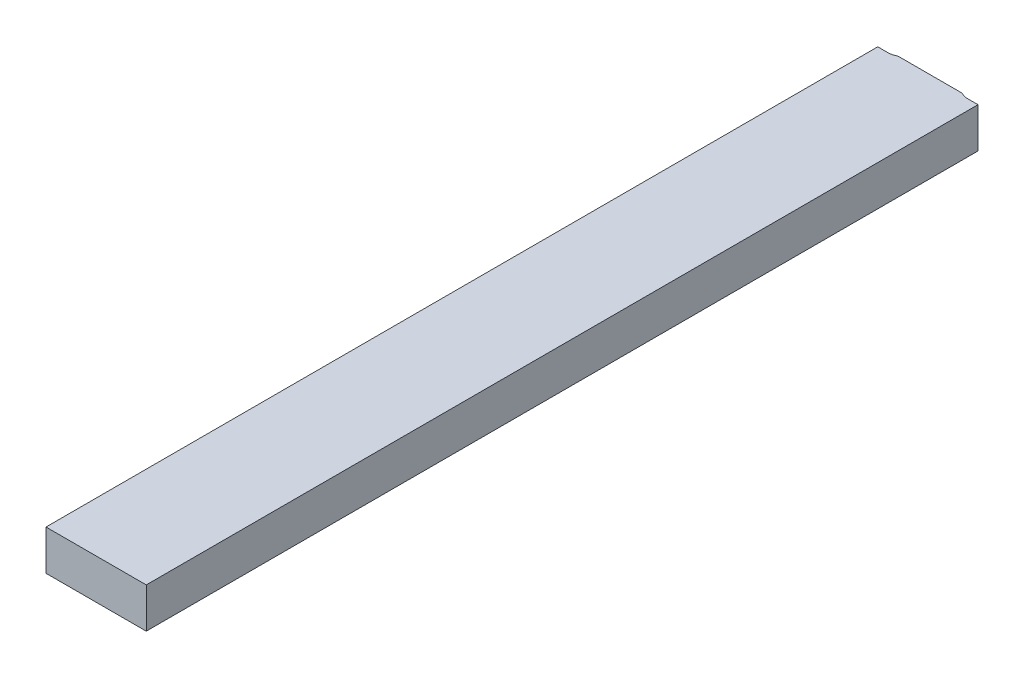
ISO-10303-21;
HEADER;
FILE_DESCRIPTION(('STEP AP214'),'2;1');
FILE_NAME('part.step','',(''),(''),'','','');
FILE_SCHEMA(('AUTOMOTIVE_DESIGN { 1 0 10303 214 1 1 1 1 }'));
ENDSEC;
DATA;
#1=APPLICATION_CONTEXT('core data for automotive mechanical design processes');
#2=APPLICATION_PROTOCOL_DEFINITION('international standard','automotive_design',2000,#1);
#3=PRODUCT_CONTEXT('',#1,'mechanical');
#4=PRODUCT('Part','Part','',(#3));
#5=PRODUCT_RELATED_PRODUCT_CATEGORY('part','',(#4));
#6=PRODUCT_DEFINITION_FORMATION('','',#4);
#7=PRODUCT_DEFINITION_CONTEXT('part definition',#1,'design');
#8=PRODUCT_DEFINITION('design','',#6,#7);
#9=PRODUCT_DEFINITION_SHAPE('','',#8);
#10=(LENGTH_UNIT() NAMED_UNIT(*) SI_UNIT(.MILLI.,.METRE.));
#11=(NAMED_UNIT(*) PLANE_ANGLE_UNIT() SI_UNIT($,.RADIAN.));
#12=(NAMED_UNIT(*) SI_UNIT($,.STERADIAN.) SOLID_ANGLE_UNIT());
#13=UNCERTAINTY_MEASURE_WITH_UNIT(LENGTH_MEASURE(1.E-05),#10,'distance_accuracy_value','');
#14=(GEOMETRIC_REPRESENTATION_CONTEXT(3) GLOBAL_UNCERTAINTY_ASSIGNED_CONTEXT((#13)) GLOBAL_UNIT_ASSIGNED_CONTEXT((#10,
#11,#12)) REPRESENTATION_CONTEXT('',''));
#15=CARTESIAN_POINT('',(0.,0.,0.));
#16=DIRECTION('',(0.,0.,1.));
#17=DIRECTION('',(1.,0.,0.));
#18=AXIS2_PLACEMENT_3D('',#15,#16,#17);
#19=CARTESIAN_POINT('',(1.5,0.275,-4.982138483571));
#20=DIRECTION('',(0.,1.,0.));
#21=DIRECTION('',(0.,0.,1.));
#22=AXIS2_PLACEMENT_3D('',#19,#20,#21);
#23=PLANE('',#22);
#24=DIRECTION('',(1.,0.,0.));
#25=VECTOR('',#24,1.);
#26=CARTESIAN_POINT('',(1.275,0.275,-7.051158663985));
#27=LINE('',#26,#25);
#28=CARTESIAN_POINT('',(1.25,0.275,-7.051158663985));
#29=VERTEX_POINT('',#28);
#30=CARTESIAN_POINT('',(1.30000000000174,0.275,-7.05115866398515));
#31=VERTEX_POINT('',#30);
#32=EDGE_CURVE('E184',#29,#31,#27,.T.);
#33=ORIENTED_EDGE('',*,*,#32,.T.);
#34=CARTESIAN_POINT('',(1.33925609382097,0.275,-7.06145062487903));
#35=CARTESIAN_POINT('',(1.33569437934613,0.275,-7.05943829430755));
#36=CARTESIAN_POINT('',(1.33197691458712,0.275,-7.05770911016996));
#37=CARTESIAN_POINT('',(1.324321331602,0.275,-7.05483826908998));
#38=CARTESIAN_POINT('',(1.32038321330713,0.275,-7.05369661233063));
#39=CARTESIAN_POINT('',(1.31100059388692,0.275,-7.05173413514556));
#40=CARTESIAN_POINT('',(1.3055037799839,0.275,-7.05115865434742));
#41=CARTESIAN_POINT('',(1.30000000000348,0.275,-7.0511586639853));
#42=B_SPLINE_CURVE_WITH_KNOTS('',3,(#34,#35,#36,#37,#38,#39,#40,#41),.UNSPECIFIED.,.F.,.F.,(4,2,
2,4),(0.,0.012254200982867,0.0245084057837981,0.0409766482847989),.UNSPECIFIED.);
#43=CARTESIAN_POINT('',(1.33925609382097,0.275,-7.06145062487903));
#44=VERTEX_POINT('',#43);
#45=EDGE_CURVE('E93',#44,#31,#42,.T.);
#46=ORIENTED_EDGE('',*,*,#45,.F.);
#47=DIRECTION('',(1.,0.,0.));
#48=VECTOR('',#47,1.);
#49=CARTESIAN_POINT('',(1.500000048204,0.275,-7.061450624879));
#50=LINE('',#49,#48);
#51=CARTESIAN_POINT('',(1.660744002588,0.275,-7.06145062487899));
#52=VERTEX_POINT('',#51);
#53=EDGE_CURVE('E89',#44,#52,#50,.T.);
#54=ORIENTED_EDGE('',*,*,#53,.T.);
#55=CARTESIAN_POINT('',(1.69999999999649,0.275,-7.05115866398509));
#56=CARTESIAN_POINT('',(1.69591120722722,0.275,-7.05116284562048));
#57=CARTESIAN_POINT('',(1.69182388666645,0.275,-7.05148113218099));
#58=CARTESIAN_POINT('',(1.68374332584176,0.275,-7.05273057454798));
#59=CARTESIAN_POINT('',(1.67975010047702,0.275,-7.05366182674584));
#60=CARTESIAN_POINT('',(1.67060917233444,0.275,-7.05654480111922));
#61=CARTESIAN_POINT('',(1.66553664971063,0.275,-7.05873731135742));
#62=CARTESIAN_POINT('',(1.660744002588,0.275,-7.06145062487899));
#63=B_SPLINE_CURVE_WITH_KNOTS('',3,(#55,#56,#57,#58,#59,#60,#61,#62),.UNSPECIFIED.,.F.,.F.,(4,2,
2,4),(0.,0.0122527379750503,0.0245074032044935,0.0409759652394011),.UNSPECIFIED.);
#64=CARTESIAN_POINT('',(1.69999999999824,0.275,-7.05115866398504));
#65=VERTEX_POINT('',#64);
#66=EDGE_CURVE('E21',#65,#52,#63,.T.);
#67=ORIENTED_EDGE('',*,*,#66,.F.);
#68=DIRECTION('',(1.,0.,0.));
#69=VECTOR('',#68,1.);
#70=CARTESIAN_POINT('',(1.725,0.275,-7.051158663985));
#71=LINE('',#70,#69);
#72=CARTESIAN_POINT('',(1.75,0.275,-7.051158663985));
#73=VERTEX_POINT('',#72);
#74=EDGE_CURVE('E84',#65,#73,#71,.T.);
#75=ORIENTED_EDGE('',*,*,#74,.T.);
#76=DIRECTION('',(0.,0.,-1.));
#77=VECTOR('',#76,1.);
#78=CARTESIAN_POINT('',(1.75,0.275,-4.976992503125));
#79=LINE('',#78,#77);
#80=CARTESIAN_POINT('',(1.75,0.275,-2.902826342264));
#81=VERTEX_POINT('',#80);
#82=EDGE_CURVE('E218',#81,#73,#79,.T.);
#83=ORIENTED_EDGE('',*,*,#82,.F.);
#84=DIRECTION('',(1.,0.,0.));
#85=VECTOR('',#84,1.);
#86=CARTESIAN_POINT('',(1.5,0.275,-2.902826342264));
#87=LINE('',#86,#85);
#88=CARTESIAN_POINT('',(1.25,0.275,-2.902826342264));
#89=VERTEX_POINT('',#88);
#90=EDGE_CURVE('E204',#89,#81,#87,.T.);
#91=ORIENTED_EDGE('',*,*,#90,.F.);
#92=DIRECTION('',(0.,0.,-1.));
#93=VECTOR('',#92,1.);
#94=CARTESIAN_POINT('',(1.25,0.275,-4.976992503125));
#95=LINE('',#94,#93);
#96=EDGE_CURVE('E176',#89,#29,#95,.T.);
#97=ORIENTED_EDGE('',*,*,#96,.T.);
#98=EDGE_LOOP('',(#33,#46,#54,#67,#75,#83,#91,#97));
#99=FACE_BOUND('',#98,.T.);
#100=ADVANCED_FACE('F17',(#99),#23,.F.);
#101=CARTESIAN_POINT('',(1.75,0.375,-4.976992503125));
#102=DIRECTION('',(1.,0.,0.));
#103=DIRECTION('',(0.,0.,-1.));
#104=AXIS2_PLACEMENT_3D('',#101,#102,#103);
#105=PLANE('',#104);
#106=DIRECTION('',(0.,0.,1.));
#107=VECTOR('',#106,1.);
#108=CARTESIAN_POINT('',(1.75,0.475,-4.982138483571));
#109=LINE('',#108,#107);
#110=CARTESIAN_POINT('',(1.75,0.475,-2.902826342264));
#111=VERTEX_POINT('',#110);
#112=CARTESIAN_POINT('',(1.75,0.475,-7.051158663985));
#113=VERTEX_POINT('',#112);
#114=EDGE_CURVE('E189',#111,#113,#109,.F.);
#115=ORIENTED_EDGE('',*,*,#114,.F.);
#116=DIRECTION('',(0.,1.,0.));
#117=VECTOR('',#116,1.);
#118=CARTESIAN_POINT('',(1.75,0.375,-2.902826342264));
#119=LINE('',#118,#117);
#120=EDGE_CURVE('E203',#81,#111,#119,.T.);
#121=ORIENTED_EDGE('',*,*,#120,.F.);
#122=ORIENTED_EDGE('',*,*,#82,.T.);
#123=DIRECTION('',(0.,1.,0.));
#124=VECTOR('',#123,1.);
#125=CARTESIAN_POINT('',(1.75,0.375,-7.051158663985));
#126=LINE('',#125,#124);
#127=EDGE_CURVE('E233',#73,#113,#126,.T.);
#128=ORIENTED_EDGE('',*,*,#127,.T.);
#129=EDGE_LOOP('',(#115,#121,#122,#128));
#130=FACE_BOUND('',#129,.T.);
#131=ADVANCED_FACE('F238',(#130),#105,.T.);
#132=CARTESIAN_POINT('',(1.725,0.375,-7.051158663985));
#133=DIRECTION('',(0.,0.,1.));
#134=DIRECTION('',(1.,0.,0.));
#135=AXIS2_PLACEMENT_3D('',#132,#133,#134);
#136=PLANE('',#135);
#137=DIRECTION('',(1.,0.,0.));
#138=VECTOR('',#137,1.);
#139=CARTESIAN_POINT('',(1.5,0.475,-7.051158663985));
#140=LINE('',#139,#138);
#141=CARTESIAN_POINT('',(1.69999992664067,0.475,-7.05115866418437));
#142=VERTEX_POINT('',#141);
#143=EDGE_CURVE('E135',#113,#142,#140,.F.);
#144=ORIENTED_EDGE('',*,*,#143,.F.);
#145=ORIENTED_EDGE('',*,*,#127,.F.);
#146=ORIENTED_EDGE('',*,*,#74,.F.);
#147=DIRECTION('',(0.,1.,0.));
#148=VECTOR('',#147,1.);
#149=CARTESIAN_POINT('',(1.7,0.2699679840491,-7.05115866398508));
#150=LINE('',#149,#148);
#151=EDGE_CURVE('E103',#142,#65,#150,.F.);
#152=ORIENTED_EDGE('',*,*,#151,.F.);
#153=EDGE_LOOP('',(#144,#145,#146,#152));
#154=FACE_BOUND('',#153,.T.);
#155=ADVANCED_FACE('F125',(#154),#136,.F.);
#156=CARTESIAN_POINT('',(1.70251960942,0.2699679840491,-7.051190309039));
#157=CARTESIAN_POINT('',(1.70168041762,0.2699679840491,-7.051166943388));
#158=CARTESIAN_POINT('',(1.695615002363,0.2699679840491,-7.051090682037));
#159=CARTESIAN_POINT('',(1.684291413794,0.2699679840491,-7.052195104335));
#160=CARTESIAN_POINT('',(1.671141350335,0.2699679840491,-7.056177217872));
#161=CARTESIAN_POINT('',(1.662024122149,0.2699679840491,-7.060613467733));
#162=CARTESIAN_POINT('',(1.657842502067,0.2699679840491,-7.063145821386));
#163=CARTESIAN_POINT('',(1.656433777303,0.2699679840491,-7.064061090588));
#164=(BOUNDED_CURVE() B_SPLINE_CURVE(3,(#156,#157,#158,#159,#160,#161,#162,#163),.UNSPECIFIED.,
.F.,.F.) B_SPLINE_CURVE_WITH_KNOTS((4,1,1,1,1,4),(0.,0.05196482602246,0.3752098129395,
0.6983604955075,0.8962889073999,1.),
.UNSPECIFIED.) CURVE() GEOMETRIC_REPRESENTATION_ITEM() RATIONAL_B_SPLINE_CURVE((1.,1.,1.,1.,1.,
1.,1.,1.)) REPRESENTATION_ITEM(''));
#165=DIRECTION('',(0.,1.,0.));
#166=VECTOR('',#165,1.);
#167=SURFACE_OF_LINEAR_EXTRUSION('',#164,#166);
#168=ORIENTED_EDGE('',*,*,#66,.T.);
#169=DIRECTION('',(0.,1.,0.));
#170=VECTOR('',#169,1.);
#171=CARTESIAN_POINT('',(1.660744002588,0.375,-7.061450624879));
#172=LINE('',#171,#170);
#173=CARTESIAN_POINT('',(1.660744002588,0.475,-7.061450624879));
#174=VERTEX_POINT('',#173);
#175=EDGE_CURVE('E97',#52,#174,#172,.T.);
#176=ORIENTED_EDGE('',*,*,#175,.T.);
#177=CARTESIAN_POINT('',(1.69999985328134,0.475,-7.05115866438369));
#178=CARTESIAN_POINT('',(1.69591106051827,0.475,-7.0511628532203));
#179=CARTESIAN_POINT('',(1.69182374051207,0.475,-7.05148114713333));
#180=CARTESIAN_POINT('',(1.6837431819355,0.475,-7.05273060421157));
#181=CARTESIAN_POINT('',(1.6797499582645,0.475,-7.05366186376829));
#182=CARTESIAN_POINT('',(1.67060908193835,0.475,-7.05654484039364));
#183=CARTESIAN_POINT('',(1.66553660692722,0.475,-7.05873733584115));
#184=CARTESIAN_POINT('',(1.660744002588,0.475,-7.06145062487898));
#185=B_SPLINE_CURVE_WITH_KNOTS('',3,(#177,#178,#179,#180,#181,#182,#183,#184),.UNSPECIFIED.,.F.,
.F.,(4,2,2,4),(0.,0.0122527379884826,0.024507403233987,0.0409758193004617),.UNSPECIFIED.);
#186=EDGE_CURVE('E129',#142,#174,#185,.T.);
#187=ORIENTED_EDGE('',*,*,#186,.F.);
#188=ORIENTED_EDGE('',*,*,#151,.T.);
#189=EDGE_LOOP('',(#168,#176,#187,#188));
#190=FACE_BOUND('',#189,.T.);
#191=ADVANCED_FACE('F100',(#190),#167,.T.);
#192=CARTESIAN_POINT('',(1.500000048204,0.375,-7.061450624879));
#193=DIRECTION('',(0.,0.,1.));
#194=DIRECTION('',(1.,0.,0.));
#195=AXIS2_PLACEMENT_3D('',#192,#193,#194);
#196=PLANE('',#195);
#197=ORIENTED_EDGE('',*,*,#53,.F.);
#198=DIRECTION('',(0.,1.,0.));
#199=VECTOR('',#198,1.);
#200=CARTESIAN_POINT('',(1.33925609382098,0.2699679840491,-7.06145062487904));
#201=LINE('',#200,#199);
#202=CARTESIAN_POINT('',(1.33925609382098,0.475,-7.06145062487903));
#203=VERTEX_POINT('',#202);
#204=EDGE_CURVE('E109',#203,#44,#201,.F.);
#205=ORIENTED_EDGE('',*,*,#204,.F.);
#206=DIRECTION('',(1.,0.,0.));
#207=VECTOR('',#206,1.);
#208=CARTESIAN_POINT('',(1.5,0.475,-7.061450624879));
#209=LINE('',#208,#207);
#210=EDGE_CURVE('E106',#174,#203,#209,.F.);
#211=ORIENTED_EDGE('',*,*,#210,.F.);
#212=ORIENTED_EDGE('',*,*,#175,.F.);
#213=EDGE_LOOP('',(#197,#205,#211,#212));
#214=FACE_BOUND('',#213,.T.);
#215=ADVANCED_FACE('F104',(#214),#196,.F.);
#216=CARTESIAN_POINT('',(1.343566307542,0.2699679840491,-7.064061118802));
#217=CARTESIAN_POINT('',(1.34215758621,0.2699679840491,-7.063145841608));
#218=CARTESIAN_POINT('',(1.337978107331,0.2699679840491,-7.060614746012));
#219=CARTESIAN_POINT('',(1.32886198488,0.2699679840491,-7.056178456814));
#220=CARTESIAN_POINT('',(1.315712040602,0.2699679840491,-7.052195755785));
#221=CARTESIAN_POINT('',(1.304386746271,0.2699679840491,-7.051090694486));
#222=CARTESIAN_POINT('',(1.298321131782,0.2699679840491,-7.051166937919));
#223=CARTESIAN_POINT('',(1.297482711636,0.2699679840491,-7.051190272618));
#224=(BOUNDED_CURVE() B_SPLINE_CURVE(3,(#216,#217,#218,#219,#220,#221,#222,#223),.UNSPECIFIED.,
.F.,.F.) B_SPLINE_CURVE_WITH_KNOTS((4,1,1,1,1,4),(0.,0.1037158878781,0.3014998794713,
0.6247605212749,0.9480806664175,1.),
.UNSPECIFIED.) CURVE() GEOMETRIC_REPRESENTATION_ITEM() RATIONAL_B_SPLINE_CURVE((1.,1.,1.,1.,1.,
1.,1.,1.)) REPRESENTATION_ITEM(''));
#225=DIRECTION('',(0.,1.,0.));
#226=VECTOR('',#225,1.);
#227=SURFACE_OF_LINEAR_EXTRUSION('',#224,#226);
#228=CARTESIAN_POINT('',(1.33925609382097,0.475,-7.06145062487904));
#229=CARTESIAN_POINT('',(1.33569437936902,0.475,-7.05943829433274));
#230=CARTESIAN_POINT('',(1.33197691459857,0.475,-7.05770911018256));
#231=CARTESIAN_POINT('',(1.32432133159056,0.475,-7.05483826907738));
#232=CARTESIAN_POINT('',(1.32038321328425,0.475,-7.05369661230544));
#233=CARTESIAN_POINT('',(1.31100064163172,0.475,-7.05173414515934));
#234=CARTESIAN_POINT('',(1.30550387761474,0.475,-7.05115866469184));
#235=CARTESIAN_POINT('',(1.30000014681143,0.475,-7.05115866438328));
#236=B_SPLINE_CURVE_WITH_KNOTS('',3,(#228,#229,#230,#231,#232,#233,#234,#235),.UNSPECIFIED.,.F.,
.F.,(4,2,2,4),(0.,0.0122542009828675,0.0245084057837986,0.0409765022206888),.UNSPECIFIED.);
#237=CARTESIAN_POINT('',(1.3,0.475,-7.051158663985));
#238=VERTEX_POINT('',#237);
#239=EDGE_CURVE('E136',#203,#238,#236,.T.);
#240=ORIENTED_EDGE('',*,*,#239,.F.);
#241=ORIENTED_EDGE('',*,*,#204,.T.);
#242=ORIENTED_EDGE('',*,*,#45,.T.);
#243=DIRECTION('',(0.,1.,0.));
#244=VECTOR('',#243,1.);
#245=CARTESIAN_POINT('',(1.3,0.375,-7.051158663985));
#246=LINE('',#245,#244);
#247=EDGE_CURVE('E182',#31,#238,#246,.T.);
#248=ORIENTED_EDGE('',*,*,#247,.T.);
#249=EDGE_LOOP('',(#240,#241,#242,#248));
#250=FACE_BOUND('',#249,.T.);
#251=ADVANCED_FACE('F159',(#250),#227,.T.);
#252=CARTESIAN_POINT('',(1.275,0.375,-7.051158663985));
#253=DIRECTION('',(0.,0.,1.));
#254=DIRECTION('',(1.,0.,0.));
#255=AXIS2_PLACEMENT_3D('',#252,#253,#254);
#256=PLANE('',#255);
#257=DIRECTION('',(1.,0.,0.));
#258=VECTOR('',#257,1.);
#259=CARTESIAN_POINT('',(1.5,0.475,-7.051158663985));
#260=LINE('',#259,#258);
#261=CARTESIAN_POINT('',(1.25,0.475,-7.051158663985));
#262=VERTEX_POINT('',#261);
#263=EDGE_CURVE('E181',#238,#262,#260,.F.);
#264=ORIENTED_EDGE('',*,*,#263,.F.);
#265=ORIENTED_EDGE('',*,*,#247,.F.);
#266=ORIENTED_EDGE('',*,*,#32,.F.);
#267=DIRECTION('',(0.,1.,0.));
#268=VECTOR('',#267,1.);
#269=CARTESIAN_POINT('',(1.25,0.375,-7.051158663985));
#270=LINE('',#269,#268);
#271=EDGE_CURVE('E174',#29,#262,#270,.T.);
#272=ORIENTED_EDGE('',*,*,#271,.T.);
#273=EDGE_LOOP('',(#264,#265,#266,#272));
#274=FACE_BOUND('',#273,.T.);
#275=ADVANCED_FACE('F157',(#274),#256,.F.);
#276=CARTESIAN_POINT('',(1.25,0.375,-4.976992503125));
#277=DIRECTION('',(1.,0.,0.));
#278=DIRECTION('',(0.,0.,-1.));
#279=AXIS2_PLACEMENT_3D('',#276,#277,#278);
#280=PLANE('',#279);
#281=ORIENTED_EDGE('',*,*,#271,.F.);
#282=ORIENTED_EDGE('',*,*,#96,.F.);
#283=DIRECTION('',(0.,1.,0.));
#284=VECTOR('',#283,1.);
#285=CARTESIAN_POINT('',(1.25,0.375,-2.902826342264));
#286=LINE('',#285,#284);
#287=CARTESIAN_POINT('',(1.25,0.475,-2.902826342264));
#288=VERTEX_POINT('',#287);
#289=EDGE_CURVE('E40',#288,#89,#286,.F.);
#290=ORIENTED_EDGE('',*,*,#289,.F.);
#291=DIRECTION('',(0.,0.,1.));
#292=VECTOR('',#291,1.);
#293=CARTESIAN_POINT('',(1.25,0.475,-4.982138483571));
#294=LINE('',#293,#292);
#295=EDGE_CURVE('E31',#262,#288,#294,.T.);
#296=ORIENTED_EDGE('',*,*,#295,.F.);
#297=EDGE_LOOP('',(#281,#282,#290,#296));
#298=FACE_BOUND('',#297,.T.);
#299=ADVANCED_FACE('F153',(#298),#280,.F.);
#300=CARTESIAN_POINT('',(1.5,0.375,-2.902826342264));
#301=DIRECTION('',(0.,0.,1.));
#302=DIRECTION('',(1.,0.,0.));
#303=AXIS2_PLACEMENT_3D('',#300,#301,#302);
#304=PLANE('',#303);
#305=ORIENTED_EDGE('',*,*,#120,.T.);
#306=DIRECTION('',(1.,0.,0.));
#307=VECTOR('',#306,1.);
#308=CARTESIAN_POINT('',(1.5,0.475,-2.902826342264));
#309=LINE('',#308,#307);
#310=EDGE_CURVE('E11',#288,#111,#309,.T.);
#311=ORIENTED_EDGE('',*,*,#310,.F.);
#312=ORIENTED_EDGE('',*,*,#289,.T.);
#313=ORIENTED_EDGE('',*,*,#90,.T.);
#314=EDGE_LOOP('',(#305,#311,#312,#313));
#315=FACE_BOUND('',#314,.T.);
#316=ADVANCED_FACE('F148',(#315),#304,.T.);
#317=CARTESIAN_POINT('',(1.5,0.475,-4.982138483571));
#318=DIRECTION('',(0.,1.,0.));
#319=DIRECTION('',(0.,0.,1.));
#320=AXIS2_PLACEMENT_3D('',#317,#318,#319);
#321=PLANE('',#320);
#322=ORIENTED_EDGE('',*,*,#295,.T.);
#323=ORIENTED_EDGE('',*,*,#310,.T.);
#324=ORIENTED_EDGE('',*,*,#114,.T.);
#325=ORIENTED_EDGE('',*,*,#143,.T.);
#326=ORIENTED_EDGE('',*,*,#186,.T.);
#327=ORIENTED_EDGE('',*,*,#210,.T.);
#328=ORIENTED_EDGE('',*,*,#239,.T.);
#329=ORIENTED_EDGE('',*,*,#263,.T.);
#330=EDGE_LOOP('',(#322,#323,#324,#325,#326,#327,#328,#329));
#331=FACE_BOUND('',#330,.T.);
#332=ADVANCED_FACE('F144',(#331),#321,.T.);
#333=CLOSED_SHELL('',(#100,#131,#155,#191,#215,#251,#275,#299,#316,#332));
#334=MANIFOLD_SOLID_BREP('B1',#333);
#335=ADVANCED_BREP_SHAPE_REPRESENTATION('',(#18,#334),#14);
#336=SHAPE_DEFINITION_REPRESENTATION(#9,#335);
ENDSEC;
END-ISO-10303-21;
